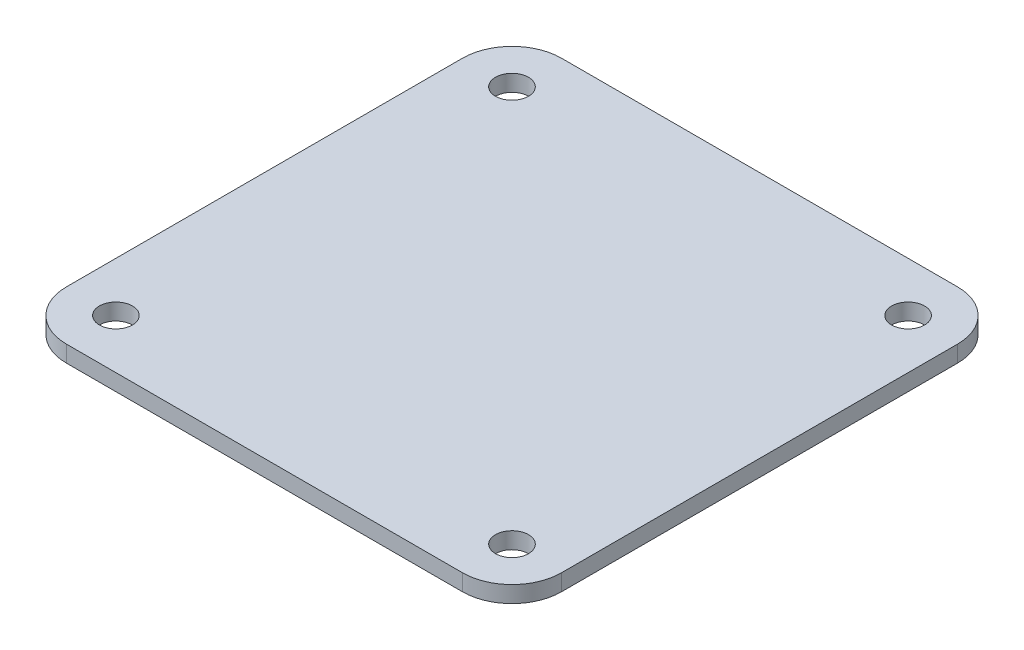
ISO-10303-21;
HEADER;
FILE_DESCRIPTION(('STEP AP214'),'2;1');
FILE_NAME('part.step','',(''),(''),'','','');
FILE_SCHEMA(('AUTOMOTIVE_DESIGN { 1 0 10303 214 1 1 1 1 }'));
ENDSEC;
DATA;
#1=APPLICATION_CONTEXT('core data for automotive mechanical design processes');
#2=APPLICATION_PROTOCOL_DEFINITION('international standard','automotive_design',2000,#1);
#3=PRODUCT_CONTEXT('',#1,'mechanical');
#4=PRODUCT('Part','Part','',(#3));
#5=PRODUCT_RELATED_PRODUCT_CATEGORY('part','',(#4));
#6=PRODUCT_DEFINITION_FORMATION('','',#4);
#7=PRODUCT_DEFINITION_CONTEXT('part definition',#1,'design');
#8=PRODUCT_DEFINITION('design','',#6,#7);
#9=PRODUCT_DEFINITION_SHAPE('','',#8);
#10=(LENGTH_UNIT() NAMED_UNIT(*) SI_UNIT(.MILLI.,.METRE.));
#11=(NAMED_UNIT(*) PLANE_ANGLE_UNIT() SI_UNIT($,.RADIAN.));
#12=(NAMED_UNIT(*) SI_UNIT($,.STERADIAN.) SOLID_ANGLE_UNIT());
#13=UNCERTAINTY_MEASURE_WITH_UNIT(LENGTH_MEASURE(1.E-05),#10,'distance_accuracy_value','');
#14=(GEOMETRIC_REPRESENTATION_CONTEXT(3) GLOBAL_UNCERTAINTY_ASSIGNED_CONTEXT((#13)) GLOBAL_UNIT_ASSIGNED_CONTEXT((#10,
#11,#12)) REPRESENTATION_CONTEXT('',''));
#15=CARTESIAN_POINT('',(0.,0.,0.));
#16=DIRECTION('',(0.,0.,1.));
#17=DIRECTION('',(1.,0.,0.));
#18=AXIS2_PLACEMENT_3D('',#15,#16,#17);
#19=CARTESIAN_POINT('',(0.,1.5875,0.));
#20=DIRECTION('',(0.,1.,0.));
#21=DIRECTION('',(0.,0.,1.));
#22=AXIS2_PLACEMENT_3D('',#19,#20,#21);
#23=PLANE('',#22);
#24=CARTESIAN_POINT('',(19.05,1.5875,19.05));
#25=DIRECTION('',(0.,1.,0.));
#26=DIRECTION('',(0.,0.,1.));
#27=AXIS2_PLACEMENT_3D('',#24,#25,#26);
#28=CIRCLE('',#27,1.5875);
#29=CARTESIAN_POINT('',(19.05,1.5875,20.6375));
#30=VERTEX_POINT('',#29);
#31=EDGE_CURVE('E186',#30,#30,#28,.T.);
#32=ORIENTED_EDGE('',*,*,#31,.F.);
#33=EDGE_LOOP('',(#32));
#34=FACE_BOUND('',#33,.T.);
#35=CARTESIAN_POINT('',(-19.05,1.5875,-19.05));
#36=DIRECTION('',(0.,1.,0.));
#37=DIRECTION('',(0.,0.,1.));
#38=AXIS2_PLACEMENT_3D('',#35,#36,#37);
#39=CIRCLE('',#38,1.5875);
#40=CARTESIAN_POINT('',(-19.05,1.5875,-17.4625));
#41=VERTEX_POINT('',#40);
#42=EDGE_CURVE('E127',#41,#41,#39,.T.);
#43=ORIENTED_EDGE('',*,*,#42,.F.);
#44=EDGE_LOOP('',(#43));
#45=FACE_BOUND('',#44,.T.);
#46=DIRECTION('',(-1.,0.,0.));
#47=VECTOR('',#46,1.);
#48=CARTESIAN_POINT('',(23.8125,1.5875,-23.8125));
#49=LINE('',#48,#47);
#50=CARTESIAN_POINT('',(19.05,1.5875,-23.8125));
#51=VERTEX_POINT('',#50);
#52=CARTESIAN_POINT('',(-19.05,1.5875,-23.8125));
#53=VERTEX_POINT('',#52);
#54=EDGE_CURVE('E136',#51,#53,#49,.T.);
#55=ORIENTED_EDGE('',*,*,#54,.T.);
#56=CARTESIAN_POINT('',(-19.05,1.5875,-19.05));
#57=DIRECTION('',(0.,1.,0.));
#58=DIRECTION('',(0.,0.,1.));
#59=AXIS2_PLACEMENT_3D('',#56,#57,#58);
#60=CIRCLE('',#59,4.7625);
#61=CARTESIAN_POINT('',(-23.8125,1.5875,-19.05));
#62=VERTEX_POINT('',#61);
#63=EDGE_CURVE('E155',#53,#62,#60,.T.);
#64=ORIENTED_EDGE('',*,*,#63,.T.);
#65=DIRECTION('',(0.,0.,1.));
#66=VECTOR('',#65,1.);
#67=CARTESIAN_POINT('',(-23.8125,1.5875,23.8125));
#68=LINE('',#67,#66);
#69=CARTESIAN_POINT('',(-23.8125,1.5875,19.05));
#70=VERTEX_POINT('',#69);
#71=EDGE_CURVE('E119',#62,#70,#68,.T.);
#72=ORIENTED_EDGE('',*,*,#71,.T.);
#73=CARTESIAN_POINT('',(-19.05,1.5875,19.05));
#74=DIRECTION('',(0.,1.,0.));
#75=DIRECTION('',(0.,0.,1.));
#76=AXIS2_PLACEMENT_3D('',#73,#74,#75);
#77=CIRCLE('',#76,4.7625);
#78=CARTESIAN_POINT('',(-19.05,1.5875,23.8125));
#79=VERTEX_POINT('',#78);
#80=EDGE_CURVE('E150',#70,#79,#77,.T.);
#81=ORIENTED_EDGE('',*,*,#80,.T.);
#82=DIRECTION('',(1.,0.,0.));
#83=VECTOR('',#82,1.);
#84=CARTESIAN_POINT('',(23.8125,1.5875,23.8125));
#85=LINE('',#84,#83);
#86=CARTESIAN_POINT('',(19.05,1.5875,23.8125));
#87=VERTEX_POINT('',#86);
#88=EDGE_CURVE('E166',#79,#87,#85,.T.);
#89=ORIENTED_EDGE('',*,*,#88,.T.);
#90=CARTESIAN_POINT('',(19.05,1.5875,19.05));
#91=DIRECTION('',(0.,1.,0.));
#92=DIRECTION('',(0.,0.,1.));
#93=AXIS2_PLACEMENT_3D('',#90,#91,#92);
#94=CIRCLE('',#93,4.7625);
#95=CARTESIAN_POINT('',(23.8125,1.5875,19.05));
#96=VERTEX_POINT('',#95);
#97=EDGE_CURVE('E55',#87,#96,#94,.T.);
#98=ORIENTED_EDGE('',*,*,#97,.T.);
#99=DIRECTION('',(0.,0.,-1.));
#100=VECTOR('',#99,1.);
#101=CARTESIAN_POINT('',(23.8125,1.5875,23.8125));
#102=LINE('',#101,#100);
#103=CARTESIAN_POINT('',(23.8125,1.5875,-19.05));
#104=VERTEX_POINT('',#103);
#105=EDGE_CURVE('E174',#96,#104,#102,.T.);
#106=ORIENTED_EDGE('',*,*,#105,.T.);
#107=CARTESIAN_POINT('',(19.05,1.5875,-19.05));
#108=DIRECTION('',(0.,1.,0.));
#109=DIRECTION('',(0.,0.,1.));
#110=AXIS2_PLACEMENT_3D('',#107,#108,#109);
#111=CIRCLE('',#110,4.7625);
#112=EDGE_CURVE('E153',#104,#51,#111,.T.);
#113=ORIENTED_EDGE('',*,*,#112,.T.);
#114=EDGE_LOOP('',(#55,#64,#72,#81,#89,#98,#106,#113));
#115=FACE_BOUND('',#114,.T.);
#116=CARTESIAN_POINT('',(19.05,1.5875,-19.05));
#117=DIRECTION('',(0.,1.,0.));
#118=DIRECTION('',(0.,0.,1.));
#119=AXIS2_PLACEMENT_3D('',#116,#117,#118);
#120=CIRCLE('',#119,1.5875);
#121=CARTESIAN_POINT('',(19.05,1.5875,-17.4625));
#122=VERTEX_POINT('',#121);
#123=EDGE_CURVE('E181',#122,#122,#120,.T.);
#124=ORIENTED_EDGE('',*,*,#123,.F.);
#125=EDGE_LOOP('',(#124));
#126=FACE_BOUND('',#125,.T.);
#127=CARTESIAN_POINT('',(-19.05,1.5875,19.05));
#128=DIRECTION('',(0.,1.,0.));
#129=DIRECTION('',(0.,0.,1.));
#130=AXIS2_PLACEMENT_3D('',#127,#128,#129);
#131=CIRCLE('',#130,1.5875);
#132=CARTESIAN_POINT('',(-19.05,1.5875,20.6375));
#133=VERTEX_POINT('',#132);
#134=EDGE_CURVE('E192',#133,#133,#131,.T.);
#135=ORIENTED_EDGE('',*,*,#134,.F.);
#136=EDGE_LOOP('',(#135));
#137=FACE_BOUND('',#136,.T.);
#138=ADVANCED_FACE('F33',(#34,#45,#115,#126,#137),#23,.T.);
#139=CARTESIAN_POINT('',(0.,0.,0.));
#140=DIRECTION('',(0.,1.,0.));
#141=DIRECTION('',(0.,0.,1.));
#142=AXIS2_PLACEMENT_3D('',#139,#140,#141);
#143=PLANE('',#142);
#144=DIRECTION('',(0.,0.,1.));
#145=VECTOR('',#144,1.);
#146=CARTESIAN_POINT('',(-23.8125,0.,23.8125));
#147=LINE('',#146,#145);
#148=CARTESIAN_POINT('',(-23.8125,0.,-19.05));
#149=VERTEX_POINT('',#148);
#150=CARTESIAN_POINT('',(-23.8125,0.,19.05));
#151=VERTEX_POINT('',#150);
#152=EDGE_CURVE('E116',#149,#151,#147,.T.);
#153=ORIENTED_EDGE('',*,*,#152,.F.);
#154=CARTESIAN_POINT('',(-19.05,0.,-19.05));
#155=DIRECTION('',(0.,1.,0.));
#156=DIRECTION('',(0.,0.,1.));
#157=AXIS2_PLACEMENT_3D('',#154,#155,#156);
#158=CIRCLE('',#157,4.7625);
#159=CARTESIAN_POINT('',(-19.05,0.,-23.8125));
#160=VERTEX_POINT('',#159);
#161=EDGE_CURVE('E99',#149,#160,#158,.F.);
#162=ORIENTED_EDGE('',*,*,#161,.T.);
#163=DIRECTION('',(-1.,0.,0.));
#164=VECTOR('',#163,1.);
#165=CARTESIAN_POINT('',(23.8125,0.,-23.8125));
#166=LINE('',#165,#164);
#167=CARTESIAN_POINT('',(19.05,0.,-23.8125));
#168=VERTEX_POINT('',#167);
#169=EDGE_CURVE('E140',#168,#160,#166,.T.);
#170=ORIENTED_EDGE('',*,*,#169,.F.);
#171=CARTESIAN_POINT('',(19.05,0.,-19.05));
#172=DIRECTION('',(0.,1.,0.));
#173=DIRECTION('',(0.,0.,1.));
#174=AXIS2_PLACEMENT_3D('',#171,#172,#173);
#175=CIRCLE('',#174,4.7625);
#176=CARTESIAN_POINT('',(23.8125,0.,-19.05));
#177=VERTEX_POINT('',#176);
#178=EDGE_CURVE('E110',#168,#177,#175,.F.);
#179=ORIENTED_EDGE('',*,*,#178,.T.);
#180=DIRECTION('',(0.,0.,-1.));
#181=VECTOR('',#180,1.);
#182=CARTESIAN_POINT('',(23.8125,0.,23.8125));
#183=LINE('',#182,#181);
#184=CARTESIAN_POINT('',(23.8125,0.,19.05));
#185=VERTEX_POINT('',#184);
#186=EDGE_CURVE('E130',#185,#177,#183,.T.);
#187=ORIENTED_EDGE('',*,*,#186,.F.);
#188=CARTESIAN_POINT('',(19.05,0.,19.05));
#189=DIRECTION('',(0.,1.,0.));
#190=DIRECTION('',(0.,0.,1.));
#191=AXIS2_PLACEMENT_3D('',#188,#189,#190);
#192=CIRCLE('',#191,4.7625);
#193=CARTESIAN_POINT('',(19.05,0.,23.8125));
#194=VERTEX_POINT('',#193);
#195=EDGE_CURVE('E144',#185,#194,#192,.F.);
#196=ORIENTED_EDGE('',*,*,#195,.T.);
#197=DIRECTION('',(1.,0.,0.));
#198=VECTOR('',#197,1.);
#199=CARTESIAN_POINT('',(23.8125,0.,23.8125));
#200=LINE('',#199,#198);
#201=CARTESIAN_POINT('',(-19.05,0.,23.8125));
#202=VERTEX_POINT('',#201);
#203=EDGE_CURVE('E126',#202,#194,#200,.T.);
#204=ORIENTED_EDGE('',*,*,#203,.F.);
#205=CARTESIAN_POINT('',(-19.05,0.,19.05));
#206=DIRECTION('',(0.,1.,0.));
#207=DIRECTION('',(0.,0.,1.));
#208=AXIS2_PLACEMENT_3D('',#205,#206,#207);
#209=CIRCLE('',#208,4.7625);
#210=EDGE_CURVE('E120',#202,#151,#209,.F.);
#211=ORIENTED_EDGE('',*,*,#210,.T.);
#212=EDGE_LOOP('',(#153,#162,#170,#179,#187,#196,#204,#211));
#213=FACE_BOUND('',#212,.T.);
#214=CARTESIAN_POINT('',(-19.05,0.,-19.05));
#215=DIRECTION('',(0.,1.,0.));
#216=DIRECTION('',(0.,0.,1.));
#217=AXIS2_PLACEMENT_3D('',#214,#215,#216);
#218=CIRCLE('',#217,1.5875);
#219=CARTESIAN_POINT('',(-19.05,0.,-17.4625));
#220=VERTEX_POINT('',#219);
#221=EDGE_CURVE('E133',#220,#220,#218,.T.);
#222=ORIENTED_EDGE('',*,*,#221,.T.);
#223=EDGE_LOOP('',(#222));
#224=FACE_BOUND('',#223,.T.);
#225=CARTESIAN_POINT('',(19.05,0.,-19.05));
#226=DIRECTION('',(0.,1.,0.));
#227=DIRECTION('',(0.,0.,1.));
#228=AXIS2_PLACEMENT_3D('',#225,#226,#227);
#229=CIRCLE('',#228,1.5875);
#230=CARTESIAN_POINT('',(19.05,0.,-17.4625));
#231=VERTEX_POINT('',#230);
#232=EDGE_CURVE('E183',#231,#231,#229,.T.);
#233=ORIENTED_EDGE('',*,*,#232,.T.);
#234=EDGE_LOOP('',(#233));
#235=FACE_BOUND('',#234,.T.);
#236=CARTESIAN_POINT('',(19.05,0.,19.05));
#237=DIRECTION('',(0.,1.,0.));
#238=DIRECTION('',(0.,0.,1.));
#239=AXIS2_PLACEMENT_3D('',#236,#237,#238);
#240=CIRCLE('',#239,1.5875);
#241=CARTESIAN_POINT('',(19.05,0.,20.6375));
#242=VERTEX_POINT('',#241);
#243=EDGE_CURVE('E189',#242,#242,#240,.T.);
#244=ORIENTED_EDGE('',*,*,#243,.T.);
#245=EDGE_LOOP('',(#244));
#246=FACE_BOUND('',#245,.T.);
#247=CARTESIAN_POINT('',(-19.05,0.,19.05));
#248=DIRECTION('',(0.,1.,0.));
#249=DIRECTION('',(0.,0.,1.));
#250=AXIS2_PLACEMENT_3D('',#247,#248,#249);
#251=CIRCLE('',#250,1.5875);
#252=CARTESIAN_POINT('',(-19.05,0.,20.6375));
#253=VERTEX_POINT('',#252);
#254=EDGE_CURVE('E195',#253,#253,#251,.T.);
#255=ORIENTED_EDGE('',*,*,#254,.T.);
#256=EDGE_LOOP('',(#255));
#257=FACE_BOUND('',#256,.T.);
#258=ADVANCED_FACE('F123',(#213,#224,#235,#246,#257),#143,.F.);
#259=CARTESIAN_POINT('',(-23.8125,1.5875,23.8125));
#260=DIRECTION('',(1.,0.,0.));
#261=DIRECTION('',(0.,0.,-1.));
#262=AXIS2_PLACEMENT_3D('',#259,#260,#261);
#263=PLANE('',#262);
#264=ORIENTED_EDGE('',*,*,#71,.F.);
#265=DIRECTION('',(0.,-1.,0.));
#266=VECTOR('',#265,1.);
#267=CARTESIAN_POINT('',(-23.8125,1.5875,-19.05));
#268=LINE('',#267,#266);
#269=EDGE_CURVE('E103',#62,#149,#268,.T.);
#270=ORIENTED_EDGE('',*,*,#269,.T.);
#271=ORIENTED_EDGE('',*,*,#152,.T.);
#272=DIRECTION('',(0.,-1.,0.));
#273=VECTOR('',#272,1.);
#274=CARTESIAN_POINT('',(-23.8125,1.5875,19.05));
#275=LINE('',#274,#273);
#276=EDGE_CURVE('E121',#151,#70,#275,.F.);
#277=ORIENTED_EDGE('',*,*,#276,.T.);
#278=EDGE_LOOP('',(#264,#270,#271,#277));
#279=FACE_BOUND('',#278,.T.);
#280=ADVANCED_FACE('F115',(#279),#263,.F.);
#281=CARTESIAN_POINT('',(23.8125,1.5875,23.8125));
#282=DIRECTION('',(0.,0.,-1.));
#283=DIRECTION('',(-1.,0.,0.));
#284=AXIS2_PLACEMENT_3D('',#281,#282,#283);
#285=PLANE('',#284);
#286=ORIENTED_EDGE('',*,*,#203,.T.);
#287=DIRECTION('',(0.,-1.,0.));
#288=VECTOR('',#287,1.);
#289=CARTESIAN_POINT('',(19.05,1.5875,23.8125));
#290=LINE('',#289,#288);
#291=EDGE_CURVE('E11',#194,#87,#290,.F.);
#292=ORIENTED_EDGE('',*,*,#291,.T.);
#293=ORIENTED_EDGE('',*,*,#88,.F.);
#294=DIRECTION('',(0.,-1.,0.));
#295=VECTOR('',#294,1.);
#296=CARTESIAN_POINT('',(-19.05,1.5875,23.8125));
#297=LINE('',#296,#295);
#298=EDGE_CURVE('E41',#79,#202,#297,.T.);
#299=ORIENTED_EDGE('',*,*,#298,.T.);
#300=EDGE_LOOP('',(#286,#292,#293,#299));
#301=FACE_BOUND('',#300,.T.);
#302=ADVANCED_FACE('F164',(#301),#285,.F.);
#303=CARTESIAN_POINT('',(23.8125,1.5875,23.8125));
#304=DIRECTION('',(-1.,0.,0.));
#305=DIRECTION('',(0.,0.,1.));
#306=AXIS2_PLACEMENT_3D('',#303,#304,#305);
#307=PLANE('',#306);
#308=ORIENTED_EDGE('',*,*,#186,.T.);
#309=DIRECTION('',(0.,-1.,0.));
#310=VECTOR('',#309,1.);
#311=CARTESIAN_POINT('',(23.8125,1.5875,-19.05));
#312=LINE('',#311,#310);
#313=EDGE_CURVE('E48',#177,#104,#312,.F.);
#314=ORIENTED_EDGE('',*,*,#313,.T.);
#315=ORIENTED_EDGE('',*,*,#105,.F.);
#316=DIRECTION('',(0.,-1.,0.));
#317=VECTOR('',#316,1.);
#318=CARTESIAN_POINT('',(23.8125,1.5875,19.05));
#319=LINE('',#318,#317);
#320=EDGE_CURVE('E157',#96,#185,#319,.T.);
#321=ORIENTED_EDGE('',*,*,#320,.T.);
#322=EDGE_LOOP('',(#308,#314,#315,#321));
#323=FACE_BOUND('',#322,.T.);
#324=ADVANCED_FACE('F173',(#323),#307,.F.);
#325=CARTESIAN_POINT('',(23.8125,1.5875,-23.8125));
#326=DIRECTION('',(0.,0.,1.));
#327=DIRECTION('',(1.,0.,0.));
#328=AXIS2_PLACEMENT_3D('',#325,#326,#327);
#329=PLANE('',#328);
#330=ORIENTED_EDGE('',*,*,#169,.T.);
#331=DIRECTION('',(0.,-1.,0.));
#332=VECTOR('',#331,1.);
#333=CARTESIAN_POINT('',(-19.05,1.5875,-23.8125));
#334=LINE('',#333,#332);
#335=EDGE_CURVE('E104',#160,#53,#334,.F.);
#336=ORIENTED_EDGE('',*,*,#335,.T.);
#337=ORIENTED_EDGE('',*,*,#54,.F.);
#338=DIRECTION('',(0.,-1.,0.));
#339=VECTOR('',#338,1.);
#340=CARTESIAN_POINT('',(19.05,1.5875,-23.8125));
#341=LINE('',#340,#339);
#342=EDGE_CURVE('E109',#51,#168,#341,.T.);
#343=ORIENTED_EDGE('',*,*,#342,.T.);
#344=EDGE_LOOP('',(#330,#336,#337,#343));
#345=FACE_BOUND('',#344,.T.);
#346=ADVANCED_FACE('F217',(#345),#329,.F.);
#347=CARTESIAN_POINT('',(-19.05,1.5875,-19.05));
#348=DIRECTION('',(0.,-1.,0.));
#349=DIRECTION('',(0.,0.,-1.));
#350=AXIS2_PLACEMENT_3D('',#347,#348,#349);
#351=CYLINDRICAL_SURFACE('',#350,1.5875);
#352=ORIENTED_EDGE('',*,*,#42,.T.);
#353=EDGE_LOOP('',(#352));
#354=FACE_BOUND('',#353,.T.);
#355=ORIENTED_EDGE('',*,*,#221,.F.);
#356=EDGE_LOOP('',(#355));
#357=FACE_BOUND('',#356,.T.);
#358=ADVANCED_FACE('F214',(#354,#357),#351,.F.);
#359=CARTESIAN_POINT('',(19.05,1.5875,-19.05));
#360=DIRECTION('',(0.,-1.,0.));
#361=DIRECTION('',(0.,0.,-1.));
#362=AXIS2_PLACEMENT_3D('',#359,#360,#361);
#363=CYLINDRICAL_SURFACE('',#362,1.5875);
#364=ORIENTED_EDGE('',*,*,#123,.T.);
#365=EDGE_LOOP('',(#364));
#366=FACE_BOUND('',#365,.T.);
#367=ORIENTED_EDGE('',*,*,#232,.F.);
#368=EDGE_LOOP('',(#367));
#369=FACE_BOUND('',#368,.T.);
#370=ADVANCED_FACE('F243',(#366,#369),#363,.F.);
#371=CARTESIAN_POINT('',(19.05,1.5875,19.05));
#372=DIRECTION('',(0.,-1.,0.));
#373=DIRECTION('',(0.,0.,-1.));
#374=AXIS2_PLACEMENT_3D('',#371,#372,#373);
#375=CYLINDRICAL_SURFACE('',#374,1.5875);
#376=ORIENTED_EDGE('',*,*,#31,.T.);
#377=EDGE_LOOP('',(#376));
#378=FACE_BOUND('',#377,.T.);
#379=ORIENTED_EDGE('',*,*,#243,.F.);
#380=EDGE_LOOP('',(#379));
#381=FACE_BOUND('',#380,.T.);
#382=ADVANCED_FACE('F246',(#378,#381),#375,.F.);
#383=CARTESIAN_POINT('',(-19.05,1.5875,19.05));
#384=DIRECTION('',(0.,-1.,0.));
#385=DIRECTION('',(0.,0.,-1.));
#386=AXIS2_PLACEMENT_3D('',#383,#384,#385);
#387=CYLINDRICAL_SURFACE('',#386,1.5875);
#388=ORIENTED_EDGE('',*,*,#134,.T.);
#389=EDGE_LOOP('',(#388));
#390=FACE_BOUND('',#389,.T.);
#391=ORIENTED_EDGE('',*,*,#254,.F.);
#392=EDGE_LOOP('',(#391));
#393=FACE_BOUND('',#392,.T.);
#394=ADVANCED_FACE('F201',(#390,#393),#387,.F.);
#395=CARTESIAN_POINT('',(-19.05,1.5875,-19.05));
#396=DIRECTION('',(0.,-1.,0.));
#397=DIRECTION('',(0.,0.,-1.));
#398=AXIS2_PLACEMENT_3D('',#395,#396,#397);
#399=CYLINDRICAL_SURFACE('',#398,4.7625);
#400=ORIENTED_EDGE('',*,*,#63,.F.);
#401=ORIENTED_EDGE('',*,*,#335,.F.);
#402=ORIENTED_EDGE('',*,*,#161,.F.);
#403=ORIENTED_EDGE('',*,*,#269,.F.);
#404=EDGE_LOOP('',(#400,#401,#402,#403));
#405=FACE_BOUND('',#404,.T.);
#406=ADVANCED_FACE('F102',(#405),#399,.T.);
#407=CARTESIAN_POINT('',(19.05,1.5875,-19.05));
#408=DIRECTION('',(0.,-1.,0.));
#409=DIRECTION('',(0.,0.,-1.));
#410=AXIS2_PLACEMENT_3D('',#407,#408,#409);
#411=CYLINDRICAL_SURFACE('',#410,4.7625);
#412=ORIENTED_EDGE('',*,*,#112,.F.);
#413=ORIENTED_EDGE('',*,*,#313,.F.);
#414=ORIENTED_EDGE('',*,*,#178,.F.);
#415=ORIENTED_EDGE('',*,*,#342,.F.);
#416=EDGE_LOOP('',(#412,#413,#414,#415));
#417=FACE_BOUND('',#416,.T.);
#418=ADVANCED_FACE('F229',(#417),#411,.T.);
#419=CARTESIAN_POINT('',(19.05,1.5875,19.05));
#420=DIRECTION('',(0.,-1.,0.));
#421=DIRECTION('',(0.,0.,-1.));
#422=AXIS2_PLACEMENT_3D('',#419,#420,#421);
#423=CYLINDRICAL_SURFACE('',#422,4.7625);
#424=ORIENTED_EDGE('',*,*,#97,.F.);
#425=ORIENTED_EDGE('',*,*,#291,.F.);
#426=ORIENTED_EDGE('',*,*,#195,.F.);
#427=ORIENTED_EDGE('',*,*,#320,.F.);
#428=EDGE_LOOP('',(#424,#425,#426,#427));
#429=FACE_BOUND('',#428,.T.);
#430=ADVANCED_FACE('F172',(#429),#423,.T.);
#431=CARTESIAN_POINT('',(-19.05,1.5875,19.05));
#432=DIRECTION('',(0.,-1.,0.));
#433=DIRECTION('',(0.,0.,-1.));
#434=AXIS2_PLACEMENT_3D('',#431,#432,#433);
#435=CYLINDRICAL_SURFACE('',#434,4.7625);
#436=ORIENTED_EDGE('',*,*,#80,.F.);
#437=ORIENTED_EDGE('',*,*,#276,.F.);
#438=ORIENTED_EDGE('',*,*,#210,.F.);
#439=ORIENTED_EDGE('',*,*,#298,.F.);
#440=EDGE_LOOP('',(#436,#437,#438,#439));
#441=FACE_BOUND('',#440,.T.);
#442=ADVANCED_FACE('F35',(#441),#435,.T.);
#443=CLOSED_SHELL('',(#138,#258,#280,#302,#324,#346,#358,#370,#382,#394,#406,#418,#430,#442));
#444=MANIFOLD_SOLID_BREP('B2',#443);
#445=ADVANCED_BREP_SHAPE_REPRESENTATION('',(#18,#444),#14);
#446=SHAPE_DEFINITION_REPRESENTATION(#9,#445);
ENDSEC;
END-ISO-10303-21;
